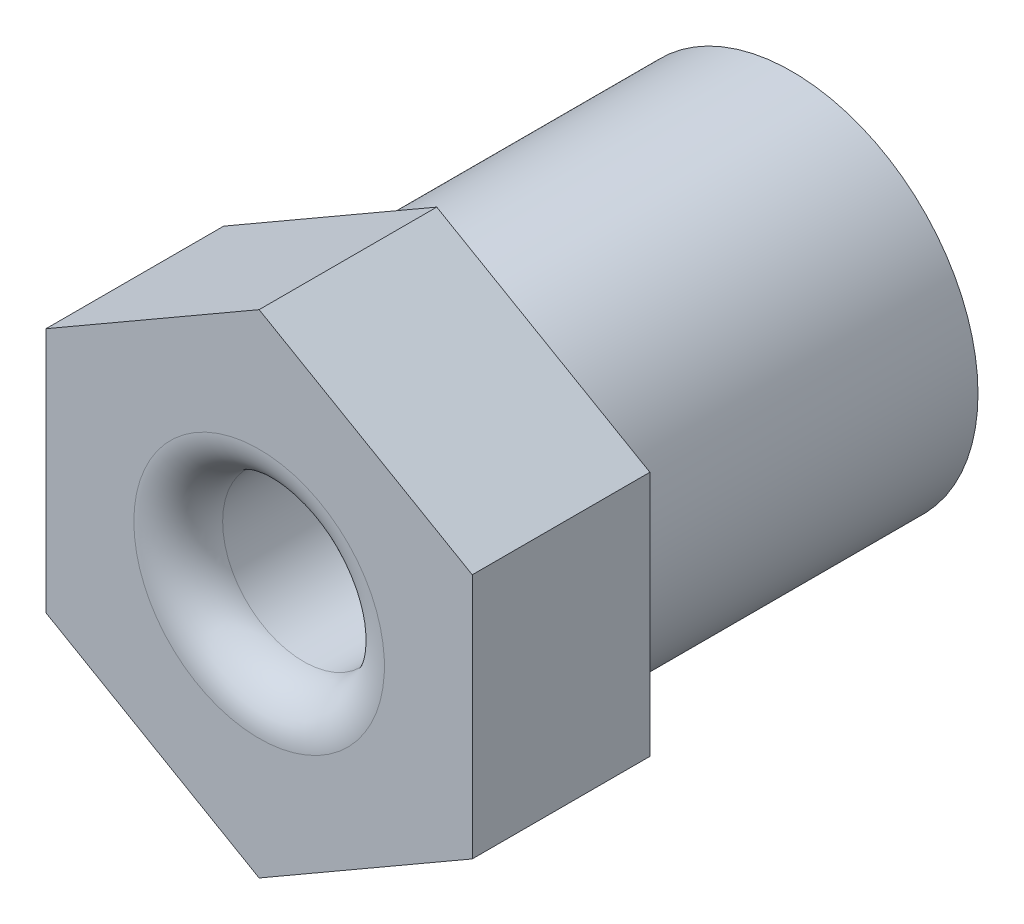
ISO-10303-21;
HEADER;
FILE_DESCRIPTION(('STEP AP214'),'2;1');
FILE_NAME('part.step','',(''),(''),'','','');
FILE_SCHEMA(('AUTOMOTIVE_DESIGN { 1 0 10303 214 1 1 1 1 }'));
ENDSEC;
DATA;
#1=APPLICATION_CONTEXT('core data for automotive mechanical design processes');
#2=APPLICATION_PROTOCOL_DEFINITION('international standard','automotive_design',2000,#1);
#3=PRODUCT_CONTEXT('',#1,'mechanical');
#4=PRODUCT('Part','Part','',(#3));
#5=PRODUCT_RELATED_PRODUCT_CATEGORY('part','',(#4));
#6=PRODUCT_DEFINITION_FORMATION('','',#4);
#7=PRODUCT_DEFINITION_CONTEXT('part definition',#1,'design');
#8=PRODUCT_DEFINITION('design','',#6,#7);
#9=PRODUCT_DEFINITION_SHAPE('','',#8);
#10=(LENGTH_UNIT() NAMED_UNIT(*) SI_UNIT(.MILLI.,.METRE.));
#11=(NAMED_UNIT(*) PLANE_ANGLE_UNIT() SI_UNIT($,.RADIAN.));
#12=(NAMED_UNIT(*) SI_UNIT($,.STERADIAN.) SOLID_ANGLE_UNIT());
#13=UNCERTAINTY_MEASURE_WITH_UNIT(LENGTH_MEASURE(1.E-05),#10,'distance_accuracy_value','');
#14=(GEOMETRIC_REPRESENTATION_CONTEXT(3) GLOBAL_UNCERTAINTY_ASSIGNED_CONTEXT((#13)) GLOBAL_UNIT_ASSIGNED_CONTEXT((#10,
#11,#12)) REPRESENTATION_CONTEXT('',''));
#15=CARTESIAN_POINT('',(0.,0.,0.));
#16=DIRECTION('',(0.,0.,1.));
#17=DIRECTION('',(1.,0.,0.));
#18=AXIS2_PLACEMENT_3D('',#15,#16,#17);
#19=CARTESIAN_POINT('',(-3.65791116486798,3.45094953686021,0.));
#20=DIRECTION('',(0.,0.,1.));
#21=DIRECTION('',(1.,0.,0.));
#22=AXIS2_PLACEMENT_3D('',#19,#20,#21);
#23=PLANE('',#22);
#24=CARTESIAN_POINT('',(-3.65791116486798,3.45094953686021,0.));
#25=DIRECTION('',(0.,0.,1.));
#26=DIRECTION('',(-1.,0.,0.));
#27=AXIS2_PLACEMENT_3D('',#24,#25,#26);
#28=CIRCLE('',#27,0.91087);
#29=CARTESIAN_POINT('',(-4.56878116486798,3.45094953686021,0.));
#30=VERTEX_POINT('',#29);
#31=EDGE_CURVE('E122',#30,#30,#28,.T.);
#32=ORIENTED_EDGE('',*,*,#31,.T.);
#33=EDGE_LOOP('',(#32));
#34=FACE_BOUND('',#33,.T.);
#35=CARTESIAN_POINT('',(-3.65791116486798,3.45094953686021,0.));
#36=DIRECTION('',(0.,0.,-1.));
#37=DIRECTION('',(1.,0.,0.));
#38=AXIS2_PLACEMENT_3D('',#35,#36,#37);
#39=CIRCLE('',#38,1.6);
#40=CARTESIAN_POINT('',(-2.05791116486798,3.45094953686021,0.));
#41=VERTEX_POINT('',#40);
#42=EDGE_CURVE('E179',#41,#41,#39,.T.);
#43=ORIENTED_EDGE('',*,*,#42,.T.);
#44=EDGE_LOOP('',(#43));
#45=FACE_BOUND('',#44,.T.);
#46=ADVANCED_FACE('F17',(#34,#45),#23,.F.);
#47=CARTESIAN_POINT('',(-1.25791116486653,4.83659053686006,0.));
#48=DIRECTION('',(1.,0.,0.));
#49=DIRECTION('',(0.,1.,0.));
#50=AXIS2_PLACEMENT_3D('',#47,#48,#49);
#51=PLANE('',#50);
#52=DIRECTION('',(0.,-1.,0.));
#53=VECTOR('',#52,1.);
#54=CARTESIAN_POINT('',(-1.25791116486653,4.83659053686006,2.));
#55=LINE('',#54,#53);
#56=CARTESIAN_POINT('',(-1.25791116486653,4.83659053686006,2.));
#57=VERTEX_POINT('',#56);
#58=CARTESIAN_POINT('',(-1.25791116486653,2.06530853686036,2.));
#59=VERTEX_POINT('',#58);
#60=EDGE_CURVE('E130',#57,#59,#55,.T.);
#61=ORIENTED_EDGE('',*,*,#60,.T.);
#62=DIRECTION('',(0.,0.,1.));
#63=VECTOR('',#62,1.);
#64=CARTESIAN_POINT('',(-1.25791116486653,2.06530853686036,0.));
#65=LINE('',#64,#63);
#66=CARTESIAN_POINT('',(-1.25791116486653,2.06530853686036,0.));
#67=VERTEX_POINT('',#66);
#68=EDGE_CURVE('E147',#67,#59,#65,.T.);
#69=ORIENTED_EDGE('',*,*,#68,.F.);
#70=DIRECTION('',(0.,-1.,0.));
#71=VECTOR('',#70,1.);
#72=CARTESIAN_POINT('',(-1.25791116486653,4.83659053686006,0.));
#73=LINE('',#72,#71);
#74=CARTESIAN_POINT('',(-1.25791116486653,4.83659053686006,0.));
#75=VERTEX_POINT('',#74);
#76=EDGE_CURVE('E166',#75,#67,#73,.T.);
#77=ORIENTED_EDGE('',*,*,#76,.F.);
#78=DIRECTION('',(0.,0.,1.));
#79=VECTOR('',#78,1.);
#80=CARTESIAN_POINT('',(-1.25791116486653,4.83659053686006,0.));
#81=LINE('',#80,#79);
#82=EDGE_CURVE('E11',#75,#57,#81,.T.);
#83=ORIENTED_EDGE('',*,*,#82,.T.);
#84=EDGE_LOOP('',(#61,#69,#77,#83));
#85=FACE_BOUND('',#84,.T.);
#86=ADVANCED_FACE('F163',(#85),#51,.T.);
#87=CARTESIAN_POINT('',(-3.65791116486798,6.22223053686048,0.));
#88=DIRECTION('',(0.499999825156066,0.866025504730608,0.));
#89=DIRECTION('',(0.,0.,-1.));
#90=AXIS2_PLACEMENT_3D('',#87,#88,#89);
#91=PLANE('',#90);
#92=DIRECTION('',(0.866025504730608,-0.499999825156065,0.));
#93=VECTOR('',#92,1.);
#94=CARTESIAN_POINT('',(-3.65791116486798,6.22223053686048,2.));
#95=LINE('',#94,#93);
#96=CARTESIAN_POINT('',(-3.65791116486798,6.22223053686048,2.));
#97=VERTEX_POINT('',#96);
#98=EDGE_CURVE('E134',#97,#57,#95,.T.);
#99=ORIENTED_EDGE('',*,*,#98,.T.);
#100=ORIENTED_EDGE('',*,*,#82,.F.);
#101=DIRECTION('',(0.866025504730608,-0.499999825156065,0.));
#102=VECTOR('',#101,1.);
#103=CARTESIAN_POINT('',(-3.65791116486798,6.22223053686048,0.));
#104=LINE('',#103,#102);
#105=CARTESIAN_POINT('',(-3.65791116486798,6.22223053686048,0.));
#106=VERTEX_POINT('',#105);
#107=EDGE_CURVE('E101',#106,#75,#104,.T.);
#108=ORIENTED_EDGE('',*,*,#107,.F.);
#109=DIRECTION('',(0.,0.,1.));
#110=VECTOR('',#109,1.);
#111=CARTESIAN_POINT('',(-3.65791116486798,6.22223053686048,0.));
#112=LINE('',#111,#110);
#113=EDGE_CURVE('E25',#106,#97,#112,.T.);
#114=ORIENTED_EDGE('',*,*,#113,.T.);
#115=EDGE_LOOP('',(#99,#100,#108,#114));
#116=FACE_BOUND('',#115,.T.);
#117=ADVANCED_FACE('F155',(#116),#91,.T.);
#118=CARTESIAN_POINT('',(-6.05791116486944,4.83659053686006,0.));
#119=DIRECTION('',(-0.499999825156066,0.866025504730608,0.));
#120=DIRECTION('',(0.,0.,1.));
#121=AXIS2_PLACEMENT_3D('',#118,#119,#120);
#122=PLANE('',#121);
#123=DIRECTION('',(0.866025504730608,0.499999825156065,0.));
#124=VECTOR('',#123,1.);
#125=CARTESIAN_POINT('',(-6.05791116486944,4.83659053686006,2.));
#126=LINE('',#125,#124);
#127=CARTESIAN_POINT('',(-6.05791116486944,4.83659053686006,2.));
#128=VERTEX_POINT('',#127);
#129=EDGE_CURVE('E138',#128,#97,#126,.T.);
#130=ORIENTED_EDGE('',*,*,#129,.T.);
#131=ORIENTED_EDGE('',*,*,#113,.F.);
#132=DIRECTION('',(0.866025504730608,0.499999825156065,0.));
#133=VECTOR('',#132,1.);
#134=CARTESIAN_POINT('',(-6.05791116486944,4.83659053686006,0.));
#135=LINE('',#134,#133);
#136=CARTESIAN_POINT('',(-6.05791116486944,4.83659053686006,0.));
#137=VERTEX_POINT('',#136);
#138=EDGE_CURVE('E95',#137,#106,#135,.T.);
#139=ORIENTED_EDGE('',*,*,#138,.F.);
#140=DIRECTION('',(0.,0.,1.));
#141=VECTOR('',#140,1.);
#142=CARTESIAN_POINT('',(-6.05791116486944,4.83659053686006,0.));
#143=LINE('',#142,#141);
#144=EDGE_CURVE('E47',#137,#128,#143,.T.);
#145=ORIENTED_EDGE('',*,*,#144,.T.);
#146=EDGE_LOOP('',(#130,#131,#139,#145));
#147=FACE_BOUND('',#146,.T.);
#148=ADVANCED_FACE('F96',(#147),#122,.T.);
#149=CARTESIAN_POINT('',(-6.05791116486944,2.06530853686036,0.));
#150=DIRECTION('',(-1.,0.,0.));
#151=DIRECTION('',(0.,0.,1.));
#152=AXIS2_PLACEMENT_3D('',#149,#150,#151);
#153=PLANE('',#152);
#154=DIRECTION('',(0.,1.,0.));
#155=VECTOR('',#154,1.);
#156=CARTESIAN_POINT('',(-6.05791116486944,2.06530853686036,2.));
#157=LINE('',#156,#155);
#158=CARTESIAN_POINT('',(-6.05791116486944,2.06530853686036,2.));
#159=VERTEX_POINT('',#158);
#160=EDGE_CURVE('E90',#159,#128,#157,.T.);
#161=ORIENTED_EDGE('',*,*,#160,.T.);
#162=ORIENTED_EDGE('',*,*,#144,.F.);
#163=DIRECTION('',(0.,1.,0.));
#164=VECTOR('',#163,1.);
#165=CARTESIAN_POINT('',(-6.05791116486944,2.06530853686036,0.));
#166=LINE('',#165,#164);
#167=CARTESIAN_POINT('',(-6.05791116486944,2.06530853686036,0.));
#168=VERTEX_POINT('',#167);
#169=EDGE_CURVE('E87',#168,#137,#166,.T.);
#170=ORIENTED_EDGE('',*,*,#169,.F.);
#171=DIRECTION('',(0.,0.,1.));
#172=VECTOR('',#171,1.);
#173=CARTESIAN_POINT('',(-6.05791116486944,2.06530853686036,0.));
#174=LINE('',#173,#172);
#175=EDGE_CURVE('E37',#168,#159,#174,.T.);
#176=ORIENTED_EDGE('',*,*,#175,.T.);
#177=EDGE_LOOP('',(#161,#162,#170,#176));
#178=FACE_BOUND('',#177,.T.);
#179=ADVANCED_FACE('F85',(#178),#153,.T.);
#180=CARTESIAN_POINT('',(-3.65791116486798,0.679668536859936,0.));
#181=DIRECTION('',(-0.499999825156065,-0.866025504730608,0.));
#182=DIRECTION('',(-0.866025504730608,0.499999825156065,0.));
#183=AXIS2_PLACEMENT_3D('',#180,#181,#182);
#184=PLANE('',#183);
#185=DIRECTION('',(-0.866025504730608,0.499999825156065,0.));
#186=VECTOR('',#185,1.);
#187=CARTESIAN_POINT('',(-3.65791116486798,0.679668536859936,2.));
#188=LINE('',#187,#186);
#189=CARTESIAN_POINT('',(-3.65791116486798,0.679668536859936,2.));
#190=VERTEX_POINT('',#189);
#191=EDGE_CURVE('E141',#190,#159,#188,.T.);
#192=ORIENTED_EDGE('',*,*,#191,.T.);
#193=ORIENTED_EDGE('',*,*,#175,.F.);
#194=DIRECTION('',(-0.866025504730608,0.499999825156065,0.));
#195=VECTOR('',#194,1.);
#196=CARTESIAN_POINT('',(-3.65791116486798,0.679668536859936,0.));
#197=LINE('',#196,#195);
#198=CARTESIAN_POINT('',(-3.65791116486798,0.679668536859936,0.));
#199=VERTEX_POINT('',#198);
#200=EDGE_CURVE('E107',#199,#168,#197,.T.);
#201=ORIENTED_EDGE('',*,*,#200,.F.);
#202=DIRECTION('',(0.,0.,1.));
#203=VECTOR('',#202,1.);
#204=CARTESIAN_POINT('',(-3.65791116486798,0.679668536859936,0.));
#205=LINE('',#204,#203);
#206=EDGE_CURVE('E144',#199,#190,#205,.T.);
#207=ORIENTED_EDGE('',*,*,#206,.T.);
#208=EDGE_LOOP('',(#192,#193,#201,#207));
#209=FACE_BOUND('',#208,.T.);
#210=ADVANCED_FACE('F295',(#209),#184,.T.);
#211=CARTESIAN_POINT('',(-1.25791116486653,2.06530853686036,0.));
#212=DIRECTION('',(0.499999825156065,-0.866025504730608,0.));
#213=DIRECTION('',(0.,0.,-1.));
#214=AXIS2_PLACEMENT_3D('',#211,#212,#213);
#215=PLANE('',#214);
#216=DIRECTION('',(-0.866025504730608,-0.499999825156065,0.));
#217=VECTOR('',#216,1.);
#218=CARTESIAN_POINT('',(-1.25791116486653,2.06530853686036,2.));
#219=LINE('',#218,#217);
#220=EDGE_CURVE('E126',#59,#190,#219,.T.);
#221=ORIENTED_EDGE('',*,*,#220,.T.);
#222=ORIENTED_EDGE('',*,*,#206,.F.);
#223=DIRECTION('',(-0.866025504730608,-0.499999825156065,0.));
#224=VECTOR('',#223,1.);
#225=CARTESIAN_POINT('',(-1.25791116486653,2.06530853686036,0.));
#226=LINE('',#225,#224);
#227=EDGE_CURVE('E114',#67,#199,#226,.T.);
#228=ORIENTED_EDGE('',*,*,#227,.F.);
#229=ORIENTED_EDGE('',*,*,#68,.T.);
#230=EDGE_LOOP('',(#221,#222,#228,#229));
#231=FACE_BOUND('',#230,.T.);
#232=ADVANCED_FACE('F286',(#231),#215,.T.);
#233=CARTESIAN_POINT('',(-3.65791116486798,3.45094953686021,2.));
#234=DIRECTION('',(0.,0.,1.));
#235=DIRECTION('',(1.,0.,0.));
#236=AXIS2_PLACEMENT_3D('',#233,#234,#235);
#237=PLANE('',#236);
#238=CARTESIAN_POINT('',(-3.65791116486798,3.45094953686021,2.));
#239=DIRECTION('',(0.,0.,1.));
#240=DIRECTION('',(-1.,0.,0.));
#241=AXIS2_PLACEMENT_3D('',#238,#239,#240);
#242=CIRCLE('',#241,1.41087);
#243=CARTESIAN_POINT('',(-5.06878116486799,3.45094953686021,2.));
#244=VERTEX_POINT('',#243);
#245=EDGE_CURVE('E121',#244,#244,#242,.T.);
#246=ORIENTED_EDGE('',*,*,#245,.F.);
#247=EDGE_LOOP('',(#246));
#248=FACE_BOUND('',#247,.T.);
#249=ORIENTED_EDGE('',*,*,#220,.F.);
#250=ORIENTED_EDGE('',*,*,#60,.F.);
#251=ORIENTED_EDGE('',*,*,#98,.F.);
#252=ORIENTED_EDGE('',*,*,#129,.F.);
#253=ORIENTED_EDGE('',*,*,#160,.F.);
#254=ORIENTED_EDGE('',*,*,#191,.F.);
#255=EDGE_LOOP('',(#249,#250,#251,#252,#253,#254));
#256=FACE_BOUND('',#255,.T.);
#257=ADVANCED_FACE('F160',(#248,#256),#237,.T.);
#258=CARTESIAN_POINT('',(-3.65791116486798,3.45094953686021,2.));
#259=DIRECTION('',(0.,0.,-1.));
#260=DIRECTION('',(-1.,0.,0.));
#261=AXIS2_PLACEMENT_3D('',#258,#259,#260);
#262=CYLINDRICAL_SURFACE('',#261,0.91087);
#263=CARTESIAN_POINT('',(-3.65791116486798,3.45094953686021,1.5));
#264=DIRECTION('',(0.,0.,-1.));
#265=DIRECTION('',(-1.,0.,0.));
#266=AXIS2_PLACEMENT_3D('',#263,#264,#265);
#267=CIRCLE('',#266,0.91087);
#268=CARTESIAN_POINT('',(-4.56878116486798,3.45094953686021,1.5));
#269=VERTEX_POINT('',#268);
#270=EDGE_CURVE('E117',#269,#269,#267,.T.);
#271=ORIENTED_EDGE('',*,*,#270,.F.);
#272=EDGE_LOOP('',(#271));
#273=FACE_BOUND('',#272,.T.);
#274=ORIENTED_EDGE('',*,*,#31,.F.);
#275=EDGE_LOOP('',(#274));
#276=FACE_BOUND('',#275,.T.);
#277=ADVANCED_FACE('F275',(#273,#276),#262,.F.);
#278=CARTESIAN_POINT('',(-3.65791116486798,3.45094953686021,1.5));
#279=DIRECTION('',(0.,0.,-1.));
#280=DIRECTION('',(-1.,0.,0.));
#281=AXIS2_PLACEMENT_3D('',#278,#279,#280);
#282=TOROIDAL_SURFACE('',#281,1.41087,0.5);
#283=ORIENTED_EDGE('',*,*,#245,.T.);
#284=EDGE_LOOP('',(#283));
#285=FACE_BOUND('',#284,.T.);
#286=ORIENTED_EDGE('',*,*,#270,.T.);
#287=EDGE_LOOP('',(#286));
#288=FACE_BOUND('',#287,.T.);
#289=ADVANCED_FACE('F277',(#285,#288),#282,.T.);
#290=CARTESIAN_POINT('',(-3.65791116486798,3.45094953686021,0.));
#291=DIRECTION('',(0.,0.,1.));
#292=DIRECTION('',(1.,0.,0.));
#293=AXIS2_PLACEMENT_3D('',#290,#291,#292);
#294=PLANE('',#293);
#295=CARTESIAN_POINT('',(-3.65791116486798,3.45094953686021,0.));
#296=DIRECTION('',(0.,0.,1.));
#297=DIRECTION('',(1.,0.,0.));
#298=AXIS2_PLACEMENT_3D('',#295,#296,#297);
#299=CIRCLE('',#298,2.095);
#300=CARTESIAN_POINT('',(-1.56291116486798,3.45094953686021,0.));
#301=VERTEX_POINT('',#300);
#302=EDGE_CURVE('E173',#301,#301,#299,.T.);
#303=ORIENTED_EDGE('',*,*,#302,.T.);
#304=EDGE_LOOP('',(#303));
#305=FACE_BOUND('',#304,.T.);
#306=ORIENTED_EDGE('',*,*,#76,.T.);
#307=ORIENTED_EDGE('',*,*,#227,.T.);
#308=ORIENTED_EDGE('',*,*,#200,.T.);
#309=ORIENTED_EDGE('',*,*,#169,.T.);
#310=ORIENTED_EDGE('',*,*,#138,.T.);
#311=ORIENTED_EDGE('',*,*,#107,.T.);
#312=EDGE_LOOP('',(#306,#307,#308,#309,#310,#311));
#313=FACE_BOUND('',#312,.T.);
#314=ADVANCED_FACE('F104',(#305,#313),#294,.F.);
#315=CARTESIAN_POINT('',(-3.65791116486798,3.45094953686021,-4.));
#316=DIRECTION('',(0.,0.,1.));
#317=DIRECTION('',(1.,0.,0.));
#318=AXIS2_PLACEMENT_3D('',#315,#316,#317);
#319=PLANE('',#318);
#320=CARTESIAN_POINT('',(-3.65791116486798,3.45094953686021,-4.));
#321=DIRECTION('',(0.,0.,1.));
#322=DIRECTION('',(1.,0.,0.));
#323=AXIS2_PLACEMENT_3D('',#320,#321,#322);
#324=CIRCLE('',#323,1.6);
#325=CARTESIAN_POINT('',(-2.05791116486798,3.45094953686021,-4.));
#326=VERTEX_POINT('',#325);
#327=EDGE_CURVE('E243',#326,#326,#324,.T.);
#328=ORIENTED_EDGE('',*,*,#327,.T.);
#329=EDGE_LOOP('',(#328));
#330=FACE_BOUND('',#329,.T.);
#331=CARTESIAN_POINT('',(-3.65791116486798,3.45094953686021,-4.));
#332=DIRECTION('',(0.,0.,1.));
#333=DIRECTION('',(1.,0.,0.));
#334=AXIS2_PLACEMENT_3D('',#331,#332,#333);
#335=CIRCLE('',#334,2.095);
#336=CARTESIAN_POINT('',(-1.56291116486798,3.45094953686021,-4.));
#337=VERTEX_POINT('',#336);
#338=EDGE_CURVE('E175',#337,#337,#335,.T.);
#339=ORIENTED_EDGE('',*,*,#338,.F.);
#340=EDGE_LOOP('',(#339));
#341=FACE_BOUND('',#340,.T.);
#342=ADVANCED_FACE('F252',(#330,#341),#319,.F.);
#343=CARTESIAN_POINT('',(-3.65791116486798,3.45094953686021,0.));
#344=DIRECTION('',(0.,0.,-1.));
#345=DIRECTION('',(1.,0.,0.));
#346=AXIS2_PLACEMENT_3D('',#343,#344,#345);
#347=CYLINDRICAL_SURFACE('',#346,2.095);
#348=ORIENTED_EDGE('',*,*,#302,.F.);
#349=EDGE_LOOP('',(#348));
#350=FACE_BOUND('',#349,.T.);
#351=ORIENTED_EDGE('',*,*,#338,.T.);
#352=EDGE_LOOP('',(#351));
#353=FACE_BOUND('',#352,.T.);
#354=ADVANCED_FACE('F257',(#350,#353),#347,.T.);
#355=CARTESIAN_POINT('',(-3.65791116486798,3.45094953686021,0.));
#356=DIRECTION('',(0.,0.,-1.));
#357=DIRECTION('',(1.,0.,0.));
#358=AXIS2_PLACEMENT_3D('',#355,#356,#357);
#359=CYLINDRICAL_SURFACE('',#358,1.6);
#360=ORIENTED_EDGE('',*,*,#42,.F.);
#361=EDGE_LOOP('',(#360));
#362=FACE_BOUND('',#361,.T.);
#363=ORIENTED_EDGE('',*,*,#327,.F.);
#364=EDGE_LOOP('',(#363));
#365=FACE_BOUND('',#364,.T.);
#366=ADVANCED_FACE('F255',(#362,#365),#359,.F.);
#367=CLOSED_SHELL('',(#46,#86,#117,#148,#179,#210,#232,#257,#277,#289,#314,#342,#354,#366));
#368=MANIFOLD_SOLID_BREP('B1',#367);
#369=ADVANCED_BREP_SHAPE_REPRESENTATION('',(#18,#368),#14);
#370=SHAPE_DEFINITION_REPRESENTATION(#9,#369);
ENDSEC;
END-ISO-10303-21;
